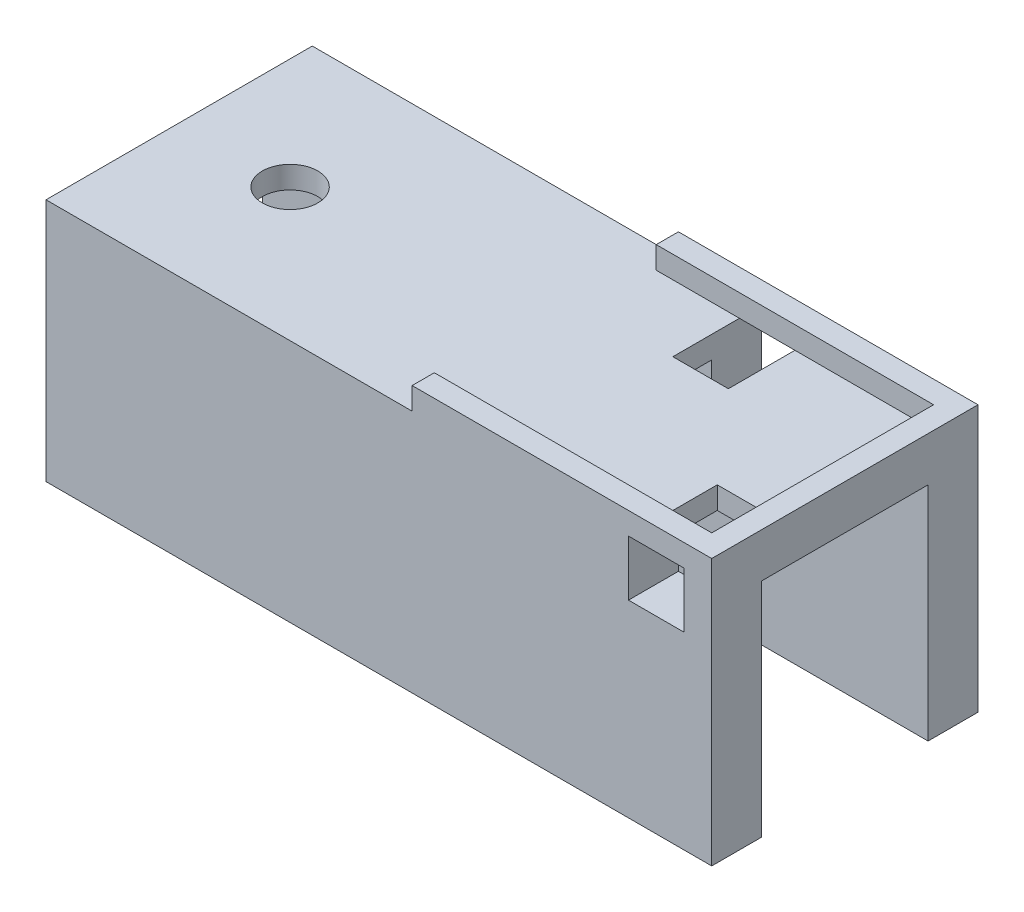
ISO-10303-21;
HEADER;
FILE_DESCRIPTION(('STEP AP214'),'2;1');
FILE_NAME('part.step','',(''),(''),'','','');
FILE_SCHEMA(('AUTOMOTIVE_DESIGN { 1 0 10303 214 1 1 1 1 }'));
ENDSEC;
DATA;
#1=APPLICATION_CONTEXT('core data for automotive mechanical design processes');
#2=APPLICATION_PROTOCOL_DEFINITION('international standard','automotive_design',2000,#1);
#3=PRODUCT_CONTEXT('',#1,'mechanical');
#4=PRODUCT('Part','Part','',(#3));
#5=PRODUCT_RELATED_PRODUCT_CATEGORY('part','',(#4));
#6=PRODUCT_DEFINITION_FORMATION('','',#4);
#7=PRODUCT_DEFINITION_CONTEXT('part definition',#1,'design');
#8=PRODUCT_DEFINITION('design','',#6,#7);
#9=PRODUCT_DEFINITION_SHAPE('','',#8);
#10=(LENGTH_UNIT() NAMED_UNIT(*) SI_UNIT(.MILLI.,.METRE.));
#11=(NAMED_UNIT(*) PLANE_ANGLE_UNIT() SI_UNIT($,.RADIAN.));
#12=(NAMED_UNIT(*) SI_UNIT($,.STERADIAN.) SOLID_ANGLE_UNIT());
#13=UNCERTAINTY_MEASURE_WITH_UNIT(LENGTH_MEASURE(1.E-05),#10,'distance_accuracy_value','');
#14=(GEOMETRIC_REPRESENTATION_CONTEXT(3) GLOBAL_UNCERTAINTY_ASSIGNED_CONTEXT((#13)) GLOBAL_UNIT_ASSIGNED_CONTEXT((#10,
#11,#12)) REPRESENTATION_CONTEXT('',''));
#15=CARTESIAN_POINT('',(0.,0.,0.));
#16=DIRECTION('',(0.,0.,1.));
#17=DIRECTION('',(1.,0.,0.));
#18=AXIS2_PLACEMENT_3D('',#15,#16,#17);
#19=CARTESIAN_POINT('',(0.,0.,0.));
#20=DIRECTION('',(0.,1.,0.));
#21=DIRECTION('',(0.,0.,1.));
#22=AXIS2_PLACEMENT_3D('',#19,#20,#21);
#23=PLANE('',#22);
#24=CARTESIAN_POINT('',(10.,0.,0.));
#25=DIRECTION('',(0.,1.,0.));
#26=DIRECTION('',(0.,0.,1.));
#27=AXIS2_PLACEMENT_3D('',#24,#25,#26);
#28=CIRCLE('',#27,2.5);
#29=CARTESIAN_POINT('',(10.,0.,2.5));
#30=VERTEX_POINT('',#29);
#31=EDGE_CURVE('E398',#30,#30,#28,.T.);
#32=ORIENTED_EDGE('',*,*,#31,.T.);
#33=EDGE_LOOP('',(#32));
#34=FACE_BOUND('',#33,.T.);
#35=DIRECTION('',(0.,0.,-1.));
#36=VECTOR('',#35,1.);
#37=CARTESIAN_POINT('',(40.5,0.,0.));
#38=LINE('',#37,#36);
#39=CARTESIAN_POINT('',(40.5,0.,-4.));
#40=VERTEX_POINT('',#39);
#41=CARTESIAN_POINT('',(40.5,0.,-7.5));
#42=VERTEX_POINT('',#41);
#43=EDGE_CURVE('E265',#40,#42,#38,.T.);
#44=ORIENTED_EDGE('',*,*,#43,.F.);
#45=DIRECTION('',(-1.,0.,0.));
#46=VECTOR('',#45,1.);
#47=CARTESIAN_POINT('',(0.,0.,-4.));
#48=LINE('',#47,#46);
#49=CARTESIAN_POINT('',(45.5,0.,-4.));
#50=VERTEX_POINT('',#49);
#51=EDGE_CURVE('E239',#50,#40,#48,.T.);
#52=ORIENTED_EDGE('',*,*,#51,.F.);
#53=DIRECTION('',(0.,0.,-1.));
#54=VECTOR('',#53,1.);
#55=CARTESIAN_POINT('',(45.5,0.,0.));
#56=LINE('',#55,#54);
#57=CARTESIAN_POINT('',(45.5,0.,-7.5));
#58=VERTEX_POINT('',#57);
#59=EDGE_CURVE('E259',#50,#58,#56,.T.);
#60=ORIENTED_EDGE('',*,*,#59,.T.);
#61=DIRECTION('',(1.,0.,0.));
#62=VECTOR('',#61,1.);
#63=CARTESIAN_POINT('',(0.,0.,-7.5));
#64=LINE('',#63,#62);
#65=CARTESIAN_POINT('',(60.,0.,-7.5));
#66=VERTEX_POINT('',#65);
#67=EDGE_CURVE('E306',#58,#66,#64,.T.);
#68=ORIENTED_EDGE('',*,*,#67,.T.);
#69=DIRECTION('',(0.,0.,-1.));
#70=VECTOR('',#69,1.);
#71=CARTESIAN_POINT('',(60.,0.,-12.));
#72=LINE('',#71,#70);
#73=CARTESIAN_POINT('',(60.,0.,7.5));
#74=VERTEX_POINT('',#73);
#75=EDGE_CURVE('E409',#74,#66,#72,.T.);
#76=ORIENTED_EDGE('',*,*,#75,.F.);
#77=DIRECTION('',(1.,0.,0.));
#78=VECTOR('',#77,1.);
#79=CARTESIAN_POINT('',(0.,0.,7.5));
#80=LINE('',#79,#78);
#81=CARTESIAN_POINT('',(57.5,0.,7.5));
#82=VERTEX_POINT('',#81);
#83=EDGE_CURVE('E326',#82,#74,#80,.T.);
#84=ORIENTED_EDGE('',*,*,#83,.F.);
#85=DIRECTION('',(0.,0.,1.));
#86=VECTOR('',#85,1.);
#87=CARTESIAN_POINT('',(57.5,0.,0.));
#88=LINE('',#87,#86);
#89=CARTESIAN_POINT('',(57.5,0.,4.));
#90=VERTEX_POINT('',#89);
#91=EDGE_CURVE('E302',#90,#82,#88,.T.);
#92=ORIENTED_EDGE('',*,*,#91,.F.);
#93=DIRECTION('',(1.,0.,0.));
#94=VECTOR('',#93,1.);
#95=CARTESIAN_POINT('',(0.,0.,4.));
#96=LINE('',#95,#94);
#97=CARTESIAN_POINT('',(52.5,0.,4.));
#98=VERTEX_POINT('',#97);
#99=EDGE_CURVE('E304',#98,#90,#96,.T.);
#100=ORIENTED_EDGE('',*,*,#99,.F.);
#101=DIRECTION('',(0.,0.,1.));
#102=VECTOR('',#101,1.);
#103=CARTESIAN_POINT('',(52.5,0.,0.));
#104=LINE('',#103,#102);
#105=CARTESIAN_POINT('',(52.5,0.,7.5));
#106=VERTEX_POINT('',#105);
#107=EDGE_CURVE('E292',#98,#106,#104,.T.);
#108=ORIENTED_EDGE('',*,*,#107,.T.);
#109=CARTESIAN_POINT('',(0.,0.,7.5));
#110=VERTEX_POINT('',#109);
#111=EDGE_CURVE('E331',#110,#106,#80,.T.);
#112=ORIENTED_EDGE('',*,*,#111,.F.);
#113=DIRECTION('',(0.,0.,1.));
#114=VECTOR('',#113,1.);
#115=CARTESIAN_POINT('',(0.,0.,-12.));
#116=LINE('',#115,#114);
#117=CARTESIAN_POINT('',(0.,0.,-7.5));
#118=VERTEX_POINT('',#117);
#119=EDGE_CURVE('E402',#118,#110,#116,.T.);
#120=ORIENTED_EDGE('',*,*,#119,.F.);
#121=EDGE_CURVE('E311',#118,#42,#64,.T.);
#122=ORIENTED_EDGE('',*,*,#121,.T.);
#123=EDGE_LOOP('',(#44,#52,#60,#68,#76,#84,#92,#100,#108,#112,#120,#122));
#124=FACE_BOUND('',#123,.T.);
#125=ADVANCED_FACE('F37',(#34,#124),#23,.F.);
#126=CARTESIAN_POINT('',(0.,2.,0.));
#127=DIRECTION('',(0.,1.,0.));
#128=DIRECTION('',(0.,0.,1.));
#129=AXIS2_PLACEMENT_3D('',#126,#127,#128);
#130=PLANE('',#129);
#131=CARTESIAN_POINT('',(10.,2.,0.));
#132=DIRECTION('',(0.,1.,0.));
#133=DIRECTION('',(0.,0.,1.));
#134=AXIS2_PLACEMENT_3D('',#131,#132,#133);
#135=CIRCLE('',#134,2.5);
#136=CARTESIAN_POINT('',(10.,2.,2.5));
#137=VERTEX_POINT('',#136);
#138=EDGE_CURVE('E399',#137,#137,#135,.T.);
#139=ORIENTED_EDGE('',*,*,#138,.F.);
#140=EDGE_LOOP('',(#139));
#141=FACE_BOUND('',#140,.T.);
#142=DIRECTION('',(-1.,0.,0.));
#143=VECTOR('',#142,1.);
#144=CARTESIAN_POINT('',(0.,1.99999999999999,-4.));
#145=LINE('',#144,#143);
#146=CARTESIAN_POINT('',(45.5,1.99999999999999,-4.));
#147=VERTEX_POINT('',#146);
#148=CARTESIAN_POINT('',(40.5,1.99999999999999,-4.));
#149=VERTEX_POINT('',#148);
#150=EDGE_CURVE('E237',#147,#149,#145,.T.);
#151=ORIENTED_EDGE('',*,*,#150,.T.);
#152=DIRECTION('',(0.,0.,-1.));
#153=VECTOR('',#152,1.);
#154=CARTESIAN_POINT('',(40.5,1.99999999999999,-4.));
#155=LINE('',#154,#153);
#156=CARTESIAN_POINT('',(40.5,1.99999999999999,-10.));
#157=VERTEX_POINT('',#156);
#158=EDGE_CURVE('E223',#149,#157,#155,.T.);
#159=ORIENTED_EDGE('',*,*,#158,.T.);
#160=DIRECTION('',(-1.,0.,0.));
#161=VECTOR('',#160,1.);
#162=CARTESIAN_POINT('',(0.,2.,-10.));
#163=LINE('',#162,#161);
#164=CARTESIAN_POINT('',(33.,2.,-10.));
#165=VERTEX_POINT('',#164);
#166=EDGE_CURVE('E347',#157,#165,#163,.T.);
#167=ORIENTED_EDGE('',*,*,#166,.T.);
#168=DIRECTION('',(0.,0.,1.));
#169=VECTOR('',#168,1.);
#170=CARTESIAN_POINT('',(33.,2.,0.));
#171=LINE('',#170,#169);
#172=CARTESIAN_POINT('',(33.,2.,-12.));
#173=VERTEX_POINT('',#172);
#174=EDGE_CURVE('E352',#173,#165,#171,.T.);
#175=ORIENTED_EDGE('',*,*,#174,.F.);
#176=DIRECTION('',(-1.,0.,0.));
#177=VECTOR('',#176,1.);
#178=CARTESIAN_POINT('',(0.,2.,-12.));
#179=LINE('',#178,#177);
#180=CARTESIAN_POINT('',(0.,2.,-12.));
#181=VERTEX_POINT('',#180);
#182=EDGE_CURVE('E412',#173,#181,#179,.T.);
#183=ORIENTED_EDGE('',*,*,#182,.T.);
#184=DIRECTION('',(0.,0.,1.));
#185=VECTOR('',#184,1.);
#186=CARTESIAN_POINT('',(0.,2.,-12.));
#187=LINE('',#186,#185);
#188=CARTESIAN_POINT('',(0.,2.,12.));
#189=VERTEX_POINT('',#188);
#190=EDGE_CURVE('E405',#181,#189,#187,.T.);
#191=ORIENTED_EDGE('',*,*,#190,.T.);
#192=DIRECTION('',(1.,0.,0.));
#193=VECTOR('',#192,1.);
#194=CARTESIAN_POINT('',(0.,2.,12.));
#195=LINE('',#194,#193);
#196=CARTESIAN_POINT('',(33.,2.,12.));
#197=VERTEX_POINT('',#196);
#198=EDGE_CURVE('E408',#189,#197,#195,.T.);
#199=ORIENTED_EDGE('',*,*,#198,.T.);
#200=CARTESIAN_POINT('',(33.,2.,10.));
#201=VERTEX_POINT('',#200);
#202=EDGE_CURVE('E379',#201,#197,#171,.T.);
#203=ORIENTED_EDGE('',*,*,#202,.F.);
#204=DIRECTION('',(1.,0.,0.));
#205=VECTOR('',#204,1.);
#206=CARTESIAN_POINT('',(0.,2.,10.));
#207=LINE('',#206,#205);
#208=CARTESIAN_POINT('',(52.5,2.,10.));
#209=VERTEX_POINT('',#208);
#210=EDGE_CURVE('E376',#201,#209,#207,.T.);
#211=ORIENTED_EDGE('',*,*,#210,.T.);
#212=DIRECTION('',(0.,0.,1.));
#213=VECTOR('',#212,1.);
#214=CARTESIAN_POINT('',(52.5,2.,4.));
#215=LINE('',#214,#213);
#216=CARTESIAN_POINT('',(52.5,2.,4.));
#217=VERTEX_POINT('',#216);
#218=EDGE_CURVE('E298',#217,#209,#215,.T.);
#219=ORIENTED_EDGE('',*,*,#218,.F.);
#220=DIRECTION('',(-1.,0.,0.));
#221=VECTOR('',#220,1.);
#222=CARTESIAN_POINT('',(0.,1.99999999999995,4.));
#223=LINE('',#222,#221);
#224=CARTESIAN_POINT('',(57.5,2.,4.));
#225=VERTEX_POINT('',#224);
#226=EDGE_CURVE('E269',#225,#217,#223,.T.);
#227=ORIENTED_EDGE('',*,*,#226,.F.);
#228=DIRECTION('',(0.,0.,1.));
#229=VECTOR('',#228,1.);
#230=CARTESIAN_POINT('',(57.5,2.,4.));
#231=LINE('',#230,#229);
#232=CARTESIAN_POINT('',(57.5,2.,10.));
#233=VERTEX_POINT('',#232);
#234=EDGE_CURVE('E289',#225,#233,#231,.T.);
#235=ORIENTED_EDGE('',*,*,#234,.T.);
#236=CARTESIAN_POINT('',(58.,2.,10.));
#237=VERTEX_POINT('',#236);
#238=EDGE_CURVE('E375',#233,#237,#207,.T.);
#239=ORIENTED_EDGE('',*,*,#238,.T.);
#240=DIRECTION('',(0.,0.,-1.));
#241=VECTOR('',#240,1.);
#242=CARTESIAN_POINT('',(58.,2.,0.));
#243=LINE('',#242,#241);
#244=CARTESIAN_POINT('',(58.,2.,-10.));
#245=VERTEX_POINT('',#244);
#246=EDGE_CURVE('E371',#237,#245,#243,.T.);
#247=ORIENTED_EDGE('',*,*,#246,.T.);
#248=CARTESIAN_POINT('',(45.5,2.,-10.));
#249=VERTEX_POINT('',#248);
#250=EDGE_CURVE('E369',#245,#249,#163,.T.);
#251=ORIENTED_EDGE('',*,*,#250,.T.);
#252=DIRECTION('',(0.,0.,-1.));
#253=VECTOR('',#252,1.);
#254=CARTESIAN_POINT('',(45.5,1.99999999999999,-4.));
#255=LINE('',#254,#253);
#256=EDGE_CURVE('E60',#147,#249,#255,.T.);
#257=ORIENTED_EDGE('',*,*,#256,.F.);
#258=EDGE_LOOP('',(#151,#159,#167,#175,#183,#191,#199,#203,#211,#219,#227,#235,#239,#247,#251,#257));
#259=FACE_BOUND('',#258,.T.);
#260=ADVANCED_FACE('F242',(#141,#259),#130,.T.);
#261=CARTESIAN_POINT('',(0.,2.,-12.));
#262=DIRECTION('',(0.,0.,1.));
#263=DIRECTION('',(1.,0.,0.));
#264=AXIS2_PLACEMENT_3D('',#261,#262,#263);
#265=PLANE('',#264);
#266=DIRECTION('',(0.,-1.,0.));
#267=VECTOR('',#266,1.);
#268=CARTESIAN_POINT('',(60.,2.,-12.));
#269=LINE('',#268,#267);
#270=CARTESIAN_POINT('',(60.,4.,-12.));
#271=VERTEX_POINT('',#270);
#272=CARTESIAN_POINT('',(60.,-20.,-12.));
#273=VERTEX_POINT('',#272);
#274=EDGE_CURVE('E419',#271,#273,#269,.T.);
#275=ORIENTED_EDGE('',*,*,#274,.T.);
#276=DIRECTION('',(1.,0.,0.));
#277=VECTOR('',#276,1.);
#278=CARTESIAN_POINT('',(0.,-20.,-12.));
#279=LINE('',#278,#277);
#280=CARTESIAN_POINT('',(0.,-20.,-12.));
#281=VERTEX_POINT('',#280);
#282=EDGE_CURVE('E314',#281,#273,#279,.T.);
#283=ORIENTED_EDGE('',*,*,#282,.F.);
#284=DIRECTION('',(0.,-1.,0.));
#285=VECTOR('',#284,1.);
#286=CARTESIAN_POINT('',(0.,2.,-12.));
#287=LINE('',#286,#285);
#288=EDGE_CURVE('E414',#181,#281,#287,.T.);
#289=ORIENTED_EDGE('',*,*,#288,.F.);
#290=ORIENTED_EDGE('',*,*,#182,.F.);
#291=DIRECTION('',(0.,-1.,0.));
#292=VECTOR('',#291,1.);
#293=CARTESIAN_POINT('',(33.,4.,-12.));
#294=LINE('',#293,#292);
#295=CARTESIAN_POINT('',(33.,4.,-12.));
#296=VERTEX_POINT('',#295);
#297=EDGE_CURVE('E385',#296,#173,#294,.T.);
#298=ORIENTED_EDGE('',*,*,#297,.F.);
#299=DIRECTION('',(-1.,0.,0.));
#300=VECTOR('',#299,1.);
#301=CARTESIAN_POINT('',(0.,4.,-12.));
#302=LINE('',#301,#300);
#303=EDGE_CURVE('E367',#271,#296,#302,.T.);
#304=ORIENTED_EDGE('',*,*,#303,.F.);
#305=EDGE_LOOP('',(#275,#283,#289,#290,#298,#304));
#306=FACE_BOUND('',#305,.T.);
#307=DIRECTION('',(0.,-1.,0.));
#308=VECTOR('',#307,1.);
#309=CARTESIAN_POINT('',(40.5,0.,-12.));
#310=LINE('',#309,#308);
#311=CARTESIAN_POINT('',(40.5,1.99999999999999,-12.));
#312=VERTEX_POINT('',#311);
#313=CARTESIAN_POINT('',(40.5,-3.00000000000001,-12.));
#314=VERTEX_POINT('',#313);
#315=EDGE_CURVE('E52',#312,#314,#310,.T.);
#316=ORIENTED_EDGE('',*,*,#315,.T.);
#317=DIRECTION('',(-1.,0.,0.));
#318=VECTOR('',#317,1.);
#319=CARTESIAN_POINT('',(0.,-3.,-12.));
#320=LINE('',#319,#318);
#321=CARTESIAN_POINT('',(45.5,-3.00000000000001,-12.));
#322=VERTEX_POINT('',#321);
#323=EDGE_CURVE('E240',#322,#314,#320,.T.);
#324=ORIENTED_EDGE('',*,*,#323,.F.);
#325=DIRECTION('',(0.,-1.,0.));
#326=VECTOR('',#325,1.);
#327=CARTESIAN_POINT('',(45.5,0.,-12.));
#328=LINE('',#327,#326);
#329=CARTESIAN_POINT('',(45.5,1.99999999999999,-12.));
#330=VERTEX_POINT('',#329);
#331=EDGE_CURVE('E252',#330,#322,#328,.T.);
#332=ORIENTED_EDGE('',*,*,#331,.F.);
#333=DIRECTION('',(-1.,0.,0.));
#334=VECTOR('',#333,1.);
#335=CARTESIAN_POINT('',(0.,1.99999999999999,-12.));
#336=LINE('',#335,#334);
#337=EDGE_CURVE('E249',#330,#312,#336,.T.);
#338=ORIENTED_EDGE('',*,*,#337,.T.);
#339=EDGE_LOOP('',(#316,#324,#332,#338));
#340=FACE_BOUND('',#339,.T.);
#341=ADVANCED_FACE('F527',(#306,#340),#265,.F.);
#342=CARTESIAN_POINT('',(0.,-20.,-7.5));
#343=DIRECTION('',(0.,0.,1.));
#344=DIRECTION('',(1.,0.,0.));
#345=AXIS2_PLACEMENT_3D('',#342,#343,#344);
#346=PLANE('',#345);
#347=DIRECTION('',(1.,0.,0.));
#348=VECTOR('',#347,1.);
#349=CARTESIAN_POINT('',(0.,-3.,-7.5));
#350=LINE('',#349,#348);
#351=CARTESIAN_POINT('',(40.5,-3.00000000000001,-7.5));
#352=VERTEX_POINT('',#351);
#353=CARTESIAN_POINT('',(45.5,-3.00000000000001,-7.5));
#354=VERTEX_POINT('',#353);
#355=EDGE_CURVE('E45',#352,#354,#350,.T.);
#356=ORIENTED_EDGE('',*,*,#355,.F.);
#357=DIRECTION('',(0.,1.,0.));
#358=VECTOR('',#357,1.);
#359=CARTESIAN_POINT('',(40.5,-20.,-7.5));
#360=LINE('',#359,#358);
#361=EDGE_CURVE('E11',#352,#42,#360,.T.);
#362=ORIENTED_EDGE('',*,*,#361,.T.);
#363=ORIENTED_EDGE('',*,*,#121,.F.);
#364=DIRECTION('',(0.,1.,0.));
#365=VECTOR('',#364,1.);
#366=CARTESIAN_POINT('',(0.,-20.,-7.5));
#367=LINE('',#366,#365);
#368=CARTESIAN_POINT('',(0.,-20.,-7.5));
#369=VERTEX_POINT('',#368);
#370=EDGE_CURVE('E324',#369,#118,#367,.T.);
#371=ORIENTED_EDGE('',*,*,#370,.F.);
#372=DIRECTION('',(1.,0.,0.));
#373=VECTOR('',#372,1.);
#374=CARTESIAN_POINT('',(0.,-20.,-7.5));
#375=LINE('',#374,#373);
#376=CARTESIAN_POINT('',(60.,-20.,-7.5));
#377=VERTEX_POINT('',#376);
#378=EDGE_CURVE('E307',#369,#377,#375,.T.);
#379=ORIENTED_EDGE('',*,*,#378,.T.);
#380=DIRECTION('',(0.,1.,0.));
#381=VECTOR('',#380,1.);
#382=CARTESIAN_POINT('',(60.,-20.,-7.5));
#383=LINE('',#382,#381);
#384=EDGE_CURVE('E319',#377,#66,#383,.T.);
#385=ORIENTED_EDGE('',*,*,#384,.T.);
#386=ORIENTED_EDGE('',*,*,#67,.F.);
#387=DIRECTION('',(0.,1.,0.));
#388=VECTOR('',#387,1.);
#389=CARTESIAN_POINT('',(45.5,-20.,-7.5));
#390=LINE('',#389,#388);
#391=EDGE_CURVE('E433',#354,#58,#390,.T.);
#392=ORIENTED_EDGE('',*,*,#391,.F.);
#393=EDGE_LOOP('',(#356,#362,#363,#371,#379,#385,#386,#392));
#394=FACE_BOUND('',#393,.T.);
#395=ADVANCED_FACE('F442',(#394),#346,.T.);
#396=CARTESIAN_POINT('',(0.,-20.,7.5));
#397=DIRECTION('',(0.,0.,1.));
#398=DIRECTION('',(1.,0.,0.));
#399=AXIS2_PLACEMENT_3D('',#396,#397,#398);
#400=PLANE('',#399);
#401=DIRECTION('',(0.,-1.,0.));
#402=VECTOR('',#401,1.);
#403=CARTESIAN_POINT('',(57.5,-20.,7.5));
#404=LINE('',#403,#402);
#405=CARTESIAN_POINT('',(57.5,-3.,7.5));
#406=VERTEX_POINT('',#405);
#407=EDGE_CURVE('E431',#82,#406,#404,.T.);
#408=ORIENTED_EDGE('',*,*,#407,.F.);
#409=ORIENTED_EDGE('',*,*,#83,.T.);
#410=DIRECTION('',(0.,1.,0.));
#411=VECTOR('',#410,1.);
#412=CARTESIAN_POINT('',(60.,-20.,7.5));
#413=LINE('',#412,#411);
#414=CARTESIAN_POINT('',(60.,-20.,7.5));
#415=VERTEX_POINT('',#414);
#416=EDGE_CURVE('E339',#415,#74,#413,.T.);
#417=ORIENTED_EDGE('',*,*,#416,.F.);
#418=DIRECTION('',(1.,0.,0.));
#419=VECTOR('',#418,1.);
#420=CARTESIAN_POINT('',(0.,-20.,7.5));
#421=LINE('',#420,#419);
#422=CARTESIAN_POINT('',(0.,-20.,7.5));
#423=VERTEX_POINT('',#422);
#424=EDGE_CURVE('E330',#423,#415,#421,.T.);
#425=ORIENTED_EDGE('',*,*,#424,.F.);
#426=DIRECTION('',(0.,1.,0.));
#427=VECTOR('',#426,1.);
#428=CARTESIAN_POINT('',(0.,-20.,7.5));
#429=LINE('',#428,#427);
#430=EDGE_CURVE('E344',#423,#110,#429,.T.);
#431=ORIENTED_EDGE('',*,*,#430,.T.);
#432=ORIENTED_EDGE('',*,*,#111,.T.);
#433=DIRECTION('',(0.,-1.,0.));
#434=VECTOR('',#433,1.);
#435=CARTESIAN_POINT('',(52.5,-20.,7.5));
#436=LINE('',#435,#434);
#437=CARTESIAN_POINT('',(52.5,-3.,7.5));
#438=VERTEX_POINT('',#437);
#439=EDGE_CURVE('E425',#106,#438,#436,.T.);
#440=ORIENTED_EDGE('',*,*,#439,.T.);
#441=DIRECTION('',(-1.,0.,0.));
#442=VECTOR('',#441,1.);
#443=CARTESIAN_POINT('',(0.,-3.00000000000001,7.5));
#444=LINE('',#443,#442);
#445=EDGE_CURVE('E428',#406,#438,#444,.T.);
#446=ORIENTED_EDGE('',*,*,#445,.F.);
#447=EDGE_LOOP('',(#408,#409,#417,#425,#431,#432,#440,#446));
#448=FACE_BOUND('',#447,.T.);
#449=ADVANCED_FACE('F470',(#448),#400,.F.);
#450=CARTESIAN_POINT('',(0.,2.,-12.));
#451=DIRECTION('',(1.,0.,0.));
#452=DIRECTION('',(0.,0.,-1.));
#453=AXIS2_PLACEMENT_3D('',#450,#451,#452);
#454=PLANE('',#453);
#455=ORIENTED_EDGE('',*,*,#288,.T.);
#456=DIRECTION('',(0.,0.,-1.));
#457=VECTOR('',#456,1.);
#458=CARTESIAN_POINT('',(0.,-20.,0.));
#459=LINE('',#458,#457);
#460=EDGE_CURVE('E310',#369,#281,#459,.T.);
#461=ORIENTED_EDGE('',*,*,#460,.F.);
#462=ORIENTED_EDGE('',*,*,#370,.T.);
#463=ORIENTED_EDGE('',*,*,#119,.T.);
#464=ORIENTED_EDGE('',*,*,#430,.F.);
#465=DIRECTION('',(0.,0.,-1.));
#466=VECTOR('',#465,1.);
#467=CARTESIAN_POINT('',(0.,-20.,0.));
#468=LINE('',#467,#466);
#469=CARTESIAN_POINT('',(0.,-20.,12.));
#470=VERTEX_POINT('',#469);
#471=EDGE_CURVE('E327',#470,#423,#468,.T.);
#472=ORIENTED_EDGE('',*,*,#471,.F.);
#473=DIRECTION('',(0.,-1.,0.));
#474=VECTOR('',#473,1.);
#475=CARTESIAN_POINT('',(0.,2.,12.));
#476=LINE('',#475,#474);
#477=EDGE_CURVE('E423',#189,#470,#476,.T.);
#478=ORIENTED_EDGE('',*,*,#477,.F.);
#479=ORIENTED_EDGE('',*,*,#190,.F.);
#480=EDGE_LOOP('',(#455,#461,#462,#463,#464,#472,#478,#479));
#481=FACE_BOUND('',#480,.T.);
#482=ADVANCED_FACE('F39',(#481),#454,.F.);
#483=CARTESIAN_POINT('',(0.,2.,12.));
#484=DIRECTION('',(0.,0.,-1.));
#485=DIRECTION('',(-1.,0.,0.));
#486=AXIS2_PLACEMENT_3D('',#483,#484,#485);
#487=PLANE('',#486);
#488=DIRECTION('',(0.,-1.,0.));
#489=VECTOR('',#488,1.);
#490=CARTESIAN_POINT('',(52.5,0.,12.));
#491=LINE('',#490,#489);
#492=CARTESIAN_POINT('',(52.5,2.,12.));
#493=VERTEX_POINT('',#492);
#494=CARTESIAN_POINT('',(52.5,-3.,12.));
#495=VERTEX_POINT('',#494);
#496=EDGE_CURVE('E281',#493,#495,#491,.T.);
#497=ORIENTED_EDGE('',*,*,#496,.F.);
#498=DIRECTION('',(-1.,0.,0.));
#499=VECTOR('',#498,1.);
#500=CARTESIAN_POINT('',(0.,1.99999999999995,12.));
#501=LINE('',#500,#499);
#502=CARTESIAN_POINT('',(57.5,2.,12.));
#503=VERTEX_POINT('',#502);
#504=EDGE_CURVE('E268',#503,#493,#501,.T.);
#505=ORIENTED_EDGE('',*,*,#504,.F.);
#506=DIRECTION('',(0.,-1.,0.));
#507=VECTOR('',#506,1.);
#508=CARTESIAN_POINT('',(57.5,0.,12.));
#509=LINE('',#508,#507);
#510=CARTESIAN_POINT('',(57.5,-3.,12.));
#511=VERTEX_POINT('',#510);
#512=EDGE_CURVE('E273',#503,#511,#509,.T.);
#513=ORIENTED_EDGE('',*,*,#512,.T.);
#514=DIRECTION('',(-1.,0.,0.));
#515=VECTOR('',#514,1.);
#516=CARTESIAN_POINT('',(0.,-3.00000000000001,12.));
#517=LINE('',#516,#515);
#518=EDGE_CURVE('E284',#511,#495,#517,.T.);
#519=ORIENTED_EDGE('',*,*,#518,.T.);
#520=EDGE_LOOP('',(#497,#505,#513,#519));
#521=FACE_BOUND('',#520,.T.);
#522=ORIENTED_EDGE('',*,*,#477,.T.);
#523=DIRECTION('',(-1.,0.,0.));
#524=VECTOR('',#523,1.);
#525=CARTESIAN_POINT('',(0.,-20.,12.));
#526=LINE('',#525,#524);
#527=CARTESIAN_POINT('',(60.,-20.,12.));
#528=VERTEX_POINT('',#527);
#529=EDGE_CURVE('E336',#528,#470,#526,.T.);
#530=ORIENTED_EDGE('',*,*,#529,.F.);
#531=DIRECTION('',(0.,-1.,0.));
#532=VECTOR('',#531,1.);
#533=CARTESIAN_POINT('',(60.,2.,12.));
#534=LINE('',#533,#532);
#535=CARTESIAN_POINT('',(60.,4.,12.));
#536=VERTEX_POINT('',#535);
#537=EDGE_CURVE('E421',#536,#528,#534,.T.);
#538=ORIENTED_EDGE('',*,*,#537,.F.);
#539=DIRECTION('',(1.,0.,0.));
#540=VECTOR('',#539,1.);
#541=CARTESIAN_POINT('',(0.,4.,12.));
#542=LINE('',#541,#540);
#543=CARTESIAN_POINT('',(33.,4.,12.));
#544=VERTEX_POINT('',#543);
#545=EDGE_CURVE('E360',#544,#536,#542,.T.);
#546=ORIENTED_EDGE('',*,*,#545,.F.);
#547=DIRECTION('',(0.,-1.,0.));
#548=VECTOR('',#547,1.);
#549=CARTESIAN_POINT('',(33.,4.,12.));
#550=LINE('',#549,#548);
#551=EDGE_CURVE('E387',#544,#197,#550,.T.);
#552=ORIENTED_EDGE('',*,*,#551,.T.);
#553=ORIENTED_EDGE('',*,*,#198,.F.);
#554=EDGE_LOOP('',(#522,#530,#538,#546,#552,#553));
#555=FACE_BOUND('',#554,.T.);
#556=ADVANCED_FACE('F482',(#521,#555),#487,.F.);
#557=CARTESIAN_POINT('',(60.,2.,-12.));
#558=DIRECTION('',(-1.,0.,0.));
#559=DIRECTION('',(0.,0.,1.));
#560=AXIS2_PLACEMENT_3D('',#557,#558,#559);
#561=PLANE('',#560);
#562=ORIENTED_EDGE('',*,*,#537,.T.);
#563=DIRECTION('',(0.,0.,1.));
#564=VECTOR('',#563,1.);
#565=CARTESIAN_POINT('',(60.,-20.,0.));
#566=LINE('',#565,#564);
#567=EDGE_CURVE('E333',#415,#528,#566,.T.);
#568=ORIENTED_EDGE('',*,*,#567,.F.);
#569=ORIENTED_EDGE('',*,*,#416,.T.);
#570=ORIENTED_EDGE('',*,*,#75,.T.);
#571=ORIENTED_EDGE('',*,*,#384,.F.);
#572=DIRECTION('',(0.,0.,1.));
#573=VECTOR('',#572,1.);
#574=CARTESIAN_POINT('',(60.,-20.,0.));
#575=LINE('',#574,#573);
#576=EDGE_CURVE('E317',#273,#377,#575,.T.);
#577=ORIENTED_EDGE('',*,*,#576,.F.);
#578=ORIENTED_EDGE('',*,*,#274,.F.);
#579=DIRECTION('',(0.,0.,-1.));
#580=VECTOR('',#579,1.);
#581=CARTESIAN_POINT('',(60.,4.,0.));
#582=LINE('',#581,#580);
#583=EDGE_CURVE('E364',#536,#271,#582,.T.);
#584=ORIENTED_EDGE('',*,*,#583,.F.);
#585=EDGE_LOOP('',(#562,#568,#569,#570,#571,#577,#578,#584));
#586=FACE_BOUND('',#585,.T.);
#587=ADVANCED_FACE('F462',(#586),#561,.F.);
#588=CARTESIAN_POINT('',(10.,2.,0.));
#589=DIRECTION('',(0.,-1.,0.));
#590=DIRECTION('',(0.,0.,-1.));
#591=AXIS2_PLACEMENT_3D('',#588,#589,#590);
#592=CYLINDRICAL_SURFACE('',#591,2.5);
#593=ORIENTED_EDGE('',*,*,#138,.T.);
#594=EDGE_LOOP('',(#593));
#595=FACE_BOUND('',#594,.T.);
#596=ORIENTED_EDGE('',*,*,#31,.F.);
#597=EDGE_LOOP('',(#596));
#598=FACE_BOUND('',#597,.T.);
#599=ADVANCED_FACE('F558',(#595,#598),#592,.F.);
#600=CARTESIAN_POINT('',(0.,4.,-10.));
#601=DIRECTION('',(0.,0.,1.));
#602=DIRECTION('',(1.,0.,0.));
#603=AXIS2_PLACEMENT_3D('',#600,#601,#602);
#604=PLANE('',#603);
#605=ORIENTED_EDGE('',*,*,#250,.F.);
#606=DIRECTION('',(0.,-1.,0.));
#607=VECTOR('',#606,1.);
#608=CARTESIAN_POINT('',(58.,4.,-10.));
#609=LINE('',#608,#607);
#610=CARTESIAN_POINT('',(58.,4.,-10.));
#611=VERTEX_POINT('',#610);
#612=EDGE_CURVE('E395',#611,#245,#609,.T.);
#613=ORIENTED_EDGE('',*,*,#612,.F.);
#614=DIRECTION('',(-1.,0.,0.));
#615=VECTOR('',#614,1.);
#616=CARTESIAN_POINT('',(0.,4.,-10.));
#617=LINE('',#616,#615);
#618=CARTESIAN_POINT('',(33.,4.,-10.));
#619=VERTEX_POINT('',#618);
#620=EDGE_CURVE('E348',#611,#619,#617,.T.);
#621=ORIENTED_EDGE('',*,*,#620,.T.);
#622=DIRECTION('',(0.,-1.,0.));
#623=VECTOR('',#622,1.);
#624=CARTESIAN_POINT('',(33.,4.,-10.));
#625=LINE('',#624,#623);
#626=EDGE_CURVE('E382',#619,#165,#625,.T.);
#627=ORIENTED_EDGE('',*,*,#626,.T.);
#628=ORIENTED_EDGE('',*,*,#166,.F.);
#629=EDGE_CURVE('E372',#249,#157,#163,.T.);
#630=ORIENTED_EDGE('',*,*,#629,.F.);
#631=EDGE_LOOP('',(#605,#613,#621,#627,#628,#630));
#632=FACE_BOUND('',#631,.T.);
#633=ADVANCED_FACE('F515',(#632),#604,.T.);
#634=CARTESIAN_POINT('',(58.,4.,0.));
#635=DIRECTION('',(-1.,0.,0.));
#636=DIRECTION('',(0.,0.,1.));
#637=AXIS2_PLACEMENT_3D('',#634,#635,#636);
#638=PLANE('',#637);
#639=ORIENTED_EDGE('',*,*,#246,.F.);
#640=DIRECTION('',(0.,-1.,0.));
#641=VECTOR('',#640,1.);
#642=CARTESIAN_POINT('',(58.,4.,10.));
#643=LINE('',#642,#641);
#644=CARTESIAN_POINT('',(58.,4.,10.));
#645=VERTEX_POINT('',#644);
#646=EDGE_CURVE('E392',#645,#237,#643,.T.);
#647=ORIENTED_EDGE('',*,*,#646,.F.);
#648=DIRECTION('',(0.,0.,-1.));
#649=VECTOR('',#648,1.);
#650=CARTESIAN_POINT('',(58.,4.,0.));
#651=LINE('',#650,#649);
#652=EDGE_CURVE('E351',#645,#611,#651,.T.);
#653=ORIENTED_EDGE('',*,*,#652,.T.);
#654=ORIENTED_EDGE('',*,*,#612,.T.);
#655=EDGE_LOOP('',(#639,#647,#653,#654));
#656=FACE_BOUND('',#655,.T.);
#657=ADVANCED_FACE('F512',(#656),#638,.T.);
#658=CARTESIAN_POINT('',(0.,4.,10.));
#659=DIRECTION('',(0.,0.,-1.));
#660=DIRECTION('',(-1.,0.,0.));
#661=AXIS2_PLACEMENT_3D('',#658,#659,#660);
#662=PLANE('',#661);
#663=ORIENTED_EDGE('',*,*,#210,.F.);
#664=DIRECTION('',(0.,-1.,0.));
#665=VECTOR('',#664,1.);
#666=CARTESIAN_POINT('',(33.,4.,10.));
#667=LINE('',#666,#665);
#668=CARTESIAN_POINT('',(33.,4.,10.));
#669=VERTEX_POINT('',#668);
#670=EDGE_CURVE('E390',#669,#201,#667,.T.);
#671=ORIENTED_EDGE('',*,*,#670,.F.);
#672=DIRECTION('',(1.,0.,0.));
#673=VECTOR('',#672,1.);
#674=CARTESIAN_POINT('',(0.,4.,10.));
#675=LINE('',#674,#673);
#676=EDGE_CURVE('E355',#669,#645,#675,.T.);
#677=ORIENTED_EDGE('',*,*,#676,.T.);
#678=ORIENTED_EDGE('',*,*,#646,.T.);
#679=ORIENTED_EDGE('',*,*,#238,.F.);
#680=EDGE_CURVE('E380',#209,#233,#207,.T.);
#681=ORIENTED_EDGE('',*,*,#680,.F.);
#682=EDGE_LOOP('',(#663,#671,#677,#678,#679,#681));
#683=FACE_BOUND('',#682,.T.);
#684=ADVANCED_FACE('F493',(#683),#662,.T.);
#685=CARTESIAN_POINT('',(33.,4.,0.));
#686=DIRECTION('',(1.,0.,0.));
#687=DIRECTION('',(0.,0.,-1.));
#688=AXIS2_PLACEMENT_3D('',#685,#686,#687);
#689=PLANE('',#688);
#690=ORIENTED_EDGE('',*,*,#202,.T.);
#691=ORIENTED_EDGE('',*,*,#551,.F.);
#692=DIRECTION('',(0.,0.,1.));
#693=VECTOR('',#692,1.);
#694=CARTESIAN_POINT('',(33.,4.,0.));
#695=LINE('',#694,#693);
#696=EDGE_CURVE('E358',#669,#544,#695,.T.);
#697=ORIENTED_EDGE('',*,*,#696,.F.);
#698=ORIENTED_EDGE('',*,*,#670,.T.);
#699=EDGE_LOOP('',(#690,#691,#697,#698));
#700=FACE_BOUND('',#699,.T.);
#701=ADVANCED_FACE('F505',(#700),#689,.F.);
#702=ORIENTED_EDGE('',*,*,#174,.T.);
#703=ORIENTED_EDGE('',*,*,#626,.F.);
#704=EDGE_CURVE('E361',#296,#619,#695,.T.);
#705=ORIENTED_EDGE('',*,*,#704,.F.);
#706=ORIENTED_EDGE('',*,*,#297,.T.);
#707=EDGE_LOOP('',(#702,#703,#705,#706));
#708=FACE_BOUND('',#707,.T.);
#709=ADVANCED_FACE('F523',(#708),#689,.F.);
#710=CARTESIAN_POINT('',(0.,4.,0.));
#711=DIRECTION('',(0.,1.,0.));
#712=DIRECTION('',(0.,0.,1.));
#713=AXIS2_PLACEMENT_3D('',#710,#711,#712);
#714=PLANE('',#713);
#715=ORIENTED_EDGE('',*,*,#620,.F.);
#716=ORIENTED_EDGE('',*,*,#652,.F.);
#717=ORIENTED_EDGE('',*,*,#676,.F.);
#718=ORIENTED_EDGE('',*,*,#696,.T.);
#719=ORIENTED_EDGE('',*,*,#545,.T.);
#720=ORIENTED_EDGE('',*,*,#583,.T.);
#721=ORIENTED_EDGE('',*,*,#303,.T.);
#722=ORIENTED_EDGE('',*,*,#704,.T.);
#723=EDGE_LOOP('',(#715,#716,#717,#718,#719,#720,#721,#722));
#724=FACE_BOUND('',#723,.T.);
#725=ADVANCED_FACE('F510',(#724),#714,.T.);
#726=CARTESIAN_POINT('',(0.,-20.,0.));
#727=DIRECTION('',(0.,-1.,0.));
#728=DIRECTION('',(0.,0.,-1.));
#729=AXIS2_PLACEMENT_3D('',#726,#727,#728);
#730=PLANE('',#729);
#731=ORIENTED_EDGE('',*,*,#471,.T.);
#732=ORIENTED_EDGE('',*,*,#424,.T.);
#733=ORIENTED_EDGE('',*,*,#567,.T.);
#734=ORIENTED_EDGE('',*,*,#529,.T.);
#735=EDGE_LOOP('',(#731,#732,#733,#734));
#736=FACE_BOUND('',#735,.T.);
#737=ADVANCED_FACE('F532',(#736),#730,.T.);
#738=CARTESIAN_POINT('',(0.,-20.,0.));
#739=DIRECTION('',(0.,-1.,0.));
#740=DIRECTION('',(0.,0.,-1.));
#741=AXIS2_PLACEMENT_3D('',#738,#739,#740);
#742=PLANE('',#741);
#743=ORIENTED_EDGE('',*,*,#378,.F.);
#744=ORIENTED_EDGE('',*,*,#460,.T.);
#745=ORIENTED_EDGE('',*,*,#282,.T.);
#746=ORIENTED_EDGE('',*,*,#576,.T.);
#747=EDGE_LOOP('',(#743,#744,#745,#746));
#748=FACE_BOUND('',#747,.T.);
#749=ADVANCED_FACE('F458',(#748),#742,.T.);
#750=CARTESIAN_POINT('',(0.,0.,4.));
#751=DIRECTION('',(0.,0.,1.));
#752=DIRECTION('',(1.,0.,0.));
#753=AXIS2_PLACEMENT_3D('',#750,#751,#752);
#754=PLANE('',#753);
#755=ORIENTED_EDGE('',*,*,#99,.T.);
#756=DIRECTION('',(0.,-1.,0.));
#757=VECTOR('',#756,1.);
#758=CARTESIAN_POINT('',(57.5,0.,4.));
#759=LINE('',#758,#757);
#760=EDGE_CURVE('E276',#225,#90,#759,.T.);
#761=ORIENTED_EDGE('',*,*,#760,.F.);
#762=ORIENTED_EDGE('',*,*,#226,.T.);
#763=DIRECTION('',(0.,-1.,0.));
#764=VECTOR('',#763,1.);
#765=CARTESIAN_POINT('',(52.5,0.,4.));
#766=LINE('',#765,#764);
#767=EDGE_CURVE('E272',#217,#98,#766,.T.);
#768=ORIENTED_EDGE('',*,*,#767,.T.);
#769=EDGE_LOOP('',(#755,#761,#762,#768));
#770=FACE_BOUND('',#769,.T.);
#771=ADVANCED_FACE('F535',(#770),#754,.T.);
#772=CARTESIAN_POINT('',(57.5,0.,4.));
#773=DIRECTION('',(-1.,0.,0.));
#774=DIRECTION('',(0.,0.,1.));
#775=AXIS2_PLACEMENT_3D('',#772,#773,#774);
#776=PLANE('',#775);
#777=ORIENTED_EDGE('',*,*,#91,.T.);
#778=ORIENTED_EDGE('',*,*,#407,.T.);
#779=DIRECTION('',(0.,0.,1.));
#780=VECTOR('',#779,1.);
#781=CARTESIAN_POINT('',(57.5,-3.,4.));
#782=LINE('',#781,#780);
#783=EDGE_CURVE('E294',#406,#511,#782,.T.);
#784=ORIENTED_EDGE('',*,*,#783,.T.);
#785=ORIENTED_EDGE('',*,*,#512,.F.);
#786=EDGE_CURVE('E293',#233,#503,#231,.T.);
#787=ORIENTED_EDGE('',*,*,#786,.F.);
#788=ORIENTED_EDGE('',*,*,#234,.F.);
#789=ORIENTED_EDGE('',*,*,#760,.T.);
#790=EDGE_LOOP('',(#777,#778,#784,#785,#787,#788,#789));
#791=FACE_BOUND('',#790,.T.);
#792=ADVANCED_FACE('F474',(#791),#776,.T.);
#793=CARTESIAN_POINT('',(0.,-3.00000000000001,4.));
#794=DIRECTION('',(0.,1.,0.));
#795=DIRECTION('',(-1.,0.,0.));
#796=AXIS2_PLACEMENT_3D('',#793,#794,#795);
#797=PLANE('',#796);
#798=ORIENTED_EDGE('',*,*,#445,.T.);
#799=DIRECTION('',(0.,0.,1.));
#800=VECTOR('',#799,1.);
#801=CARTESIAN_POINT('',(52.5,-3.,4.));
#802=LINE('',#801,#800);
#803=EDGE_CURVE('E296',#438,#495,#802,.T.);
#804=ORIENTED_EDGE('',*,*,#803,.T.);
#805=ORIENTED_EDGE('',*,*,#518,.F.);
#806=ORIENTED_EDGE('',*,*,#783,.F.);
#807=EDGE_LOOP('',(#798,#804,#805,#806));
#808=FACE_BOUND('',#807,.T.);
#809=ADVANCED_FACE('F478',(#808),#797,.T.);
#810=CARTESIAN_POINT('',(52.5,0.,4.));
#811=DIRECTION('',(-1.,0.,0.));
#812=DIRECTION('',(0.,0.,1.));
#813=AXIS2_PLACEMENT_3D('',#810,#811,#812);
#814=PLANE('',#813);
#815=ORIENTED_EDGE('',*,*,#767,.F.);
#816=ORIENTED_EDGE('',*,*,#218,.T.);
#817=EDGE_CURVE('E279',#209,#493,#215,.T.);
#818=ORIENTED_EDGE('',*,*,#817,.T.);
#819=ORIENTED_EDGE('',*,*,#496,.T.);
#820=ORIENTED_EDGE('',*,*,#803,.F.);
#821=ORIENTED_EDGE('',*,*,#439,.F.);
#822=ORIENTED_EDGE('',*,*,#107,.F.);
#823=EDGE_LOOP('',(#815,#816,#818,#819,#820,#821,#822));
#824=FACE_BOUND('',#823,.T.);
#825=ADVANCED_FACE('F499',(#824),#814,.F.);
#826=CARTESIAN_POINT('',(0.,1.99999999999995,4.));
#827=DIRECTION('',(0.,1.,0.));
#828=DIRECTION('',(-1.,0.,0.));
#829=AXIS2_PLACEMENT_3D('',#826,#827,#828);
#830=PLANE('',#829);
#831=ORIENTED_EDGE('',*,*,#680,.T.);
#832=ORIENTED_EDGE('',*,*,#786,.T.);
#833=ORIENTED_EDGE('',*,*,#504,.T.);
#834=ORIENTED_EDGE('',*,*,#817,.F.);
#835=EDGE_LOOP('',(#831,#832,#833,#834));
#836=FACE_BOUND('',#835,.T.);
#837=ADVANCED_FACE('F496',(#836),#830,.F.);
#838=CARTESIAN_POINT('',(0.,0.,-4.));
#839=DIRECTION('',(0.,0.,-1.));
#840=DIRECTION('',(-1.,0.,0.));
#841=AXIS2_PLACEMENT_3D('',#838,#839,#840);
#842=PLANE('',#841);
#843=ORIENTED_EDGE('',*,*,#51,.T.);
#844=DIRECTION('',(0.,-1.,0.));
#845=VECTOR('',#844,1.);
#846=CARTESIAN_POINT('',(40.5,0.,-4.));
#847=LINE('',#846,#845);
#848=EDGE_CURVE('E226',#149,#40,#847,.T.);
#849=ORIENTED_EDGE('',*,*,#848,.F.);
#850=ORIENTED_EDGE('',*,*,#150,.F.);
#851=DIRECTION('',(0.,-1.,0.));
#852=VECTOR('',#851,1.);
#853=CARTESIAN_POINT('',(45.5,0.,-4.));
#854=LINE('',#853,#852);
#855=EDGE_CURVE('E244',#147,#50,#854,.T.);
#856=ORIENTED_EDGE('',*,*,#855,.T.);
#857=EDGE_LOOP('',(#843,#849,#850,#856));
#858=FACE_BOUND('',#857,.T.);
#859=ADVANCED_FACE('F235',(#858),#842,.T.);
#860=CARTESIAN_POINT('',(40.5,0.,-4.));
#861=DIRECTION('',(1.,0.,0.));
#862=DIRECTION('',(0.,0.,-1.));
#863=AXIS2_PLACEMENT_3D('',#860,#861,#862);
#864=PLANE('',#863);
#865=ORIENTED_EDGE('',*,*,#43,.T.);
#866=ORIENTED_EDGE('',*,*,#361,.F.);
#867=DIRECTION('',(0.,0.,-1.));
#868=VECTOR('',#867,1.);
#869=CARTESIAN_POINT('',(40.5,-3.00000000000001,-4.));
#870=LINE('',#869,#868);
#871=EDGE_CURVE('E257',#352,#314,#870,.T.);
#872=ORIENTED_EDGE('',*,*,#871,.T.);
#873=ORIENTED_EDGE('',*,*,#315,.F.);
#874=EDGE_CURVE('E228',#157,#312,#155,.T.);
#875=ORIENTED_EDGE('',*,*,#874,.F.);
#876=ORIENTED_EDGE('',*,*,#158,.F.);
#877=ORIENTED_EDGE('',*,*,#848,.T.);
#878=EDGE_LOOP('',(#865,#866,#872,#873,#875,#876,#877));
#879=FACE_BOUND('',#878,.T.);
#880=ADVANCED_FACE('F225',(#879),#864,.T.);
#881=CARTESIAN_POINT('',(45.5,0.,-4.));
#882=DIRECTION('',(1.,0.,0.));
#883=DIRECTION('',(0.,0.,-1.));
#884=AXIS2_PLACEMENT_3D('',#881,#882,#883);
#885=PLANE('',#884);
#886=ORIENTED_EDGE('',*,*,#855,.F.);
#887=ORIENTED_EDGE('',*,*,#256,.T.);
#888=EDGE_CURVE('E232',#249,#330,#255,.T.);
#889=ORIENTED_EDGE('',*,*,#888,.T.);
#890=ORIENTED_EDGE('',*,*,#331,.T.);
#891=DIRECTION('',(0.,0.,-1.));
#892=VECTOR('',#891,1.);
#893=CARTESIAN_POINT('',(45.5,-3.00000000000001,-4.));
#894=LINE('',#893,#892);
#895=EDGE_CURVE('E260',#354,#322,#894,.T.);
#896=ORIENTED_EDGE('',*,*,#895,.F.);
#897=ORIENTED_EDGE('',*,*,#391,.T.);
#898=ORIENTED_EDGE('',*,*,#59,.F.);
#899=EDGE_LOOP('',(#886,#887,#889,#890,#896,#897,#898));
#900=FACE_BOUND('',#899,.T.);
#901=ADVANCED_FACE('F443',(#900),#885,.F.);
#902=CARTESIAN_POINT('',(0.,-3.,-4.));
#903=DIRECTION('',(0.,-1.,0.));
#904=DIRECTION('',(1.,0.,0.));
#905=AXIS2_PLACEMENT_3D('',#902,#903,#904);
#906=PLANE('',#905);
#907=ORIENTED_EDGE('',*,*,#355,.T.);
#908=ORIENTED_EDGE('',*,*,#895,.T.);
#909=ORIENTED_EDGE('',*,*,#323,.T.);
#910=ORIENTED_EDGE('',*,*,#871,.F.);
#911=EDGE_LOOP('',(#907,#908,#909,#910));
#912=FACE_BOUND('',#911,.T.);
#913=ADVANCED_FACE('F439',(#912),#906,.F.);
#914=CARTESIAN_POINT('',(0.,1.99999999999999,-4.));
#915=DIRECTION('',(0.,-1.,0.));
#916=DIRECTION('',(1.,0.,0.));
#917=AXIS2_PLACEMENT_3D('',#914,#915,#916);
#918=PLANE('',#917);
#919=ORIENTED_EDGE('',*,*,#874,.T.);
#920=ORIENTED_EDGE('',*,*,#337,.F.);
#921=ORIENTED_EDGE('',*,*,#888,.F.);
#922=ORIENTED_EDGE('',*,*,#629,.T.);
#923=EDGE_LOOP('',(#919,#920,#921,#922));
#924=FACE_BOUND('',#923,.T.);
#925=ADVANCED_FACE('F784',(#924),#918,.T.);
#926=CLOSED_SHELL('',(#125,#260,#341,#395,#449,#482,#556,#587,#599,#633,#657,#684,#701,#709,
#725,#737,#749,#771,#792,#809,#825,#837,#859,#880,#901,#913,#925));
#927=MANIFOLD_SOLID_BREP('B2',#926);
#928=ADVANCED_BREP_SHAPE_REPRESENTATION('',(#18,#927),#14);
#929=SHAPE_DEFINITION_REPRESENTATION(#9,#928);
ENDSEC;
END-ISO-10303-21;
